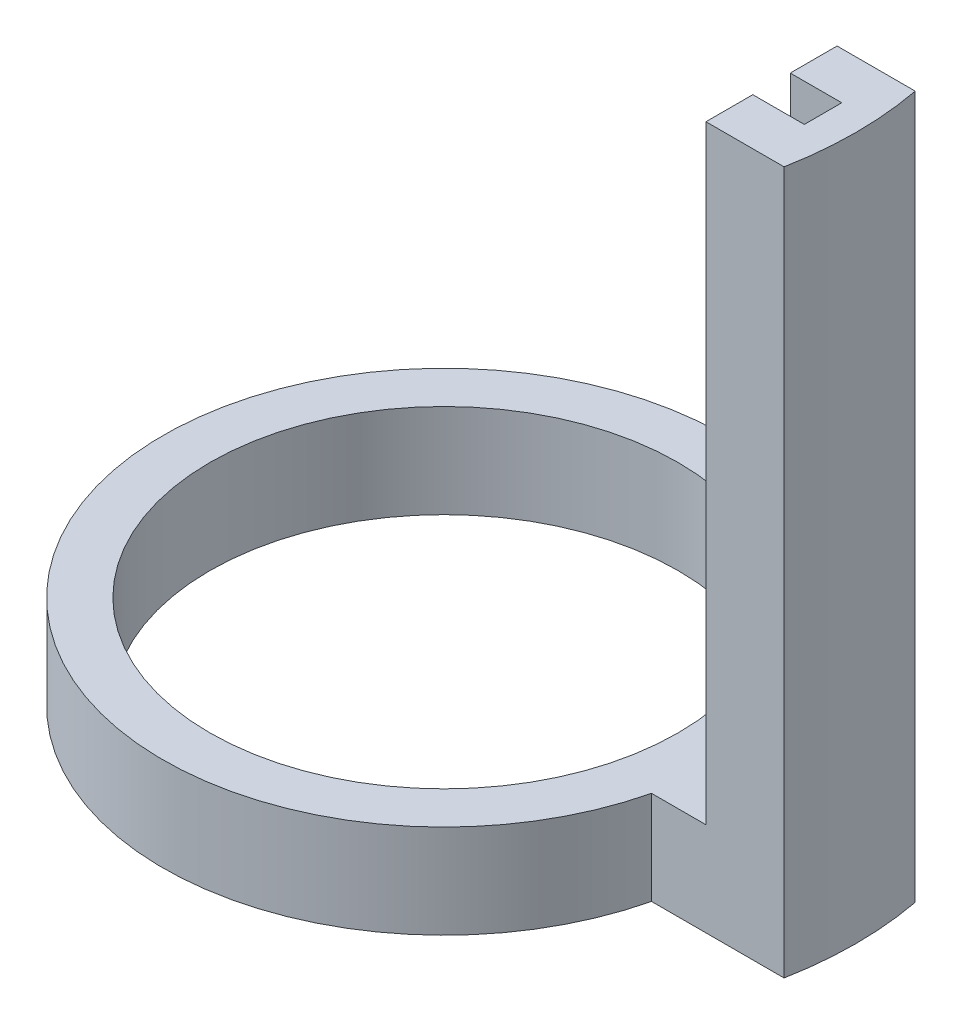
ISO-10303-21;
HEADER;
FILE_DESCRIPTION(('STEP AP214'),'2;1');
FILE_NAME('part.step','',(''),(''),'','','');
FILE_SCHEMA(('AUTOMOTIVE_DESIGN { 1 0 10303 214 1 1 1 1 }'));
ENDSEC;
DATA;
#1=APPLICATION_CONTEXT('core data for automotive mechanical design processes');
#2=APPLICATION_PROTOCOL_DEFINITION('international standard','automotive_design',2000,#1);
#3=PRODUCT_CONTEXT('',#1,'mechanical');
#4=PRODUCT('Part','Part','',(#3));
#5=PRODUCT_RELATED_PRODUCT_CATEGORY('part','',(#4));
#6=PRODUCT_DEFINITION_FORMATION('','',#4);
#7=PRODUCT_DEFINITION_CONTEXT('part definition',#1,'design');
#8=PRODUCT_DEFINITION('design','',#6,#7);
#9=PRODUCT_DEFINITION_SHAPE('','',#8);
#10=(LENGTH_UNIT() NAMED_UNIT(*) SI_UNIT(.MILLI.,.METRE.));
#11=(NAMED_UNIT(*) PLANE_ANGLE_UNIT() SI_UNIT($,.RADIAN.));
#12=(NAMED_UNIT(*) SI_UNIT($,.STERADIAN.) SOLID_ANGLE_UNIT());
#13=UNCERTAINTY_MEASURE_WITH_UNIT(LENGTH_MEASURE(1.E-05),#10,'distance_accuracy_value','');
#14=(GEOMETRIC_REPRESENTATION_CONTEXT(3) GLOBAL_UNCERTAINTY_ASSIGNED_CONTEXT((#13)) GLOBAL_UNIT_ASSIGNED_CONTEXT((#10,
#11,#12)) REPRESENTATION_CONTEXT('',''));
#15=CARTESIAN_POINT('',(0.,0.,0.));
#16=DIRECTION('',(0.,0.,1.));
#17=DIRECTION('',(1.,0.,0.));
#18=AXIS2_PLACEMENT_3D('',#15,#16,#17);
#19=CARTESIAN_POINT('',(61.9470591331992,20.,0.));
#20=DIRECTION('',(1.,0.,0.));
#21=DIRECTION('',(0.,0.,-1.));
#22=AXIS2_PLACEMENT_3D('',#19,#20,#21);
#23=PLANE('',#22);
#24=DIRECTION('',(0.,-1.,0.));
#25=VECTOR('',#24,1.);
#26=CARTESIAN_POINT('',(61.9470591331992,150.,4.02210053993576));
#27=LINE('',#26,#25);
#28=CARTESIAN_POINT('',(61.9470591331992,20.,4.02210053993576));
#29=VERTEX_POINT('',#28);
#30=CARTESIAN_POINT('',(61.9470591331992,0.,4.02210053993576));
#31=VERTEX_POINT('',#30);
#32=EDGE_CURVE('E140',#29,#31,#27,.T.);
#33=ORIENTED_EDGE('',*,*,#32,.T.);
#34=DIRECTION('',(0.,0.,1.));
#35=VECTOR('',#34,1.);
#36=CARTESIAN_POINT('',(61.9470591331992,0.,0.));
#37=LINE('',#36,#35);
#38=CARTESIAN_POINT('',(61.9470591331992,0.,-3.97870375115252));
#39=VERTEX_POINT('',#38);
#40=EDGE_CURVE('E111',#39,#31,#37,.T.);
#41=ORIENTED_EDGE('',*,*,#40,.F.);
#42=DIRECTION('',(0.,-1.,0.));
#43=VECTOR('',#42,1.);
#44=CARTESIAN_POINT('',(61.9470591331992,150.,-3.97870375115252));
#45=LINE('',#44,#43);
#46=CARTESIAN_POINT('',(61.9470591331992,20.,-3.97870375115252));
#47=VERTEX_POINT('',#46);
#48=EDGE_CURVE('E159',#47,#39,#45,.T.);
#49=ORIENTED_EDGE('',*,*,#48,.F.);
#50=DIRECTION('',(0.,0.,1.));
#51=VECTOR('',#50,1.);
#52=CARTESIAN_POINT('',(61.9470591331992,20.,0.));
#53=LINE('',#52,#51);
#54=EDGE_CURVE('E106',#47,#29,#53,.T.);
#55=ORIENTED_EDGE('',*,*,#54,.T.);
#56=EDGE_LOOP('',(#33,#41,#49,#55));
#57=FACE_BOUND('',#56,.T.);
#58=ADVANCED_FACE('F39',(#57),#23,.T.);
#59=CARTESIAN_POINT('',(0.,20.,-13.9787037511525));
#60=DIRECTION('',(0.,0.,1.));
#61=DIRECTION('',(1.,0.,0.));
#62=AXIS2_PLACEMENT_3D('',#59,#60,#61);
#63=PLANE('',#62);
#64=DIRECTION('',(-1.,0.,0.));
#65=VECTOR('',#64,1.);
#66=CARTESIAN_POINT('',(0.,0.,-13.9787037511525));
#67=LINE('',#66,#65);
#68=CARTESIAN_POINT('',(78.6328504462978,0.,-13.9787037511525));
#69=VERTEX_POINT('',#68);
#70=CARTESIAN_POINT('',(50.3391647642275,0.,-13.9787037511525));
#71=VERTEX_POINT('',#70);
#72=EDGE_CURVE('E85',#69,#71,#67,.T.);
#73=ORIENTED_EDGE('',*,*,#72,.T.);
#74=DIRECTION('',(0.,-1.,0.));
#75=VECTOR('',#74,1.);
#76=CARTESIAN_POINT('',(50.3391647642275,20.,-13.9787037511525));
#77=LINE('',#76,#75);
#78=CARTESIAN_POINT('',(50.3391647642275,20.,-13.9787037511525));
#79=VERTEX_POINT('',#78);
#80=EDGE_CURVE('E11',#79,#71,#77,.T.);
#81=ORIENTED_EDGE('',*,*,#80,.F.);
#82=DIRECTION('',(-1.,0.,0.));
#83=VECTOR('',#82,1.);
#84=CARTESIAN_POINT('',(0.,20.,-13.9787037511525));
#85=LINE('',#84,#83);
#86=CARTESIAN_POINT('',(61.9470591331992,20.,-13.9787037511525));
#87=VERTEX_POINT('',#86);
#88=EDGE_CURVE('E122',#87,#79,#85,.T.);
#89=ORIENTED_EDGE('',*,*,#88,.F.);
#90=DIRECTION('',(0.,-1.,0.));
#91=VECTOR('',#90,1.);
#92=CARTESIAN_POINT('',(61.9470591331992,150.,-13.9787037511525));
#93=LINE('',#92,#91);
#94=CARTESIAN_POINT('',(61.9470591331992,150.,-13.9787037511525));
#95=VERTEX_POINT('',#94);
#96=EDGE_CURVE('E151',#95,#87,#93,.T.);
#97=ORIENTED_EDGE('',*,*,#96,.F.);
#98=DIRECTION('',(-1.,0.,0.));
#99=VECTOR('',#98,1.);
#100=CARTESIAN_POINT('',(0.,150.,-13.9787037511525));
#101=LINE('',#100,#99);
#102=CARTESIAN_POINT('',(78.6328504462978,150.,-13.9787037511525));
#103=VERTEX_POINT('',#102);
#104=EDGE_CURVE('E184',#103,#95,#101,.T.);
#105=ORIENTED_EDGE('',*,*,#104,.F.);
#106=DIRECTION('',(0.,-1.,0.));
#107=VECTOR('',#106,1.);
#108=CARTESIAN_POINT('',(78.6328504462978,150.,-13.9787037511525));
#109=LINE('',#108,#107);
#110=EDGE_CURVE('E147',#103,#69,#109,.T.);
#111=ORIENTED_EDGE('',*,*,#110,.T.);
#112=EDGE_LOOP('',(#73,#81,#89,#97,#105,#111));
#113=FACE_BOUND('',#112,.T.);
#114=ADVANCED_FACE('F283',(#113),#63,.F.);
#115=CARTESIAN_POINT('',(-8.00974989095282,20.,0.));
#116=DIRECTION('',(0.,-1.,0.));
#117=DIRECTION('',(0.,0.,-1.));
#118=AXIS2_PLACEMENT_3D('',#115,#116,#117);
#119=CYLINDRICAL_SURFACE('',#118,60.);
#120=CARTESIAN_POINT('',(-8.00974989095282,0.,0.));
#121=DIRECTION('',(0.,1.,0.));
#122=DIRECTION('',(0.,0.,1.));
#123=AXIS2_PLACEMENT_3D('',#120,#121,#122);
#124=CIRCLE('',#123,60.);
#125=CARTESIAN_POINT('',(50.3287510877999,0.,14.0221005399358));
#126=VERTEX_POINT('',#125);
#127=EDGE_CURVE('E75',#71,#126,#124,.T.);
#128=ORIENTED_EDGE('',*,*,#127,.T.);
#129=DIRECTION('',(0.,-1.,0.));
#130=VECTOR('',#129,1.);
#131=CARTESIAN_POINT('',(50.3287510877999,20.,14.0221005399358));
#132=LINE('',#131,#130);
#133=CARTESIAN_POINT('',(50.3287510877999,20.,14.0221005399358));
#134=VERTEX_POINT('',#133);
#135=EDGE_CURVE('E47',#134,#126,#132,.T.);
#136=ORIENTED_EDGE('',*,*,#135,.F.);
#137=CARTESIAN_POINT('',(-8.00974989095282,20.,0.));
#138=DIRECTION('',(0.,1.,0.));
#139=DIRECTION('',(0.,0.,1.));
#140=AXIS2_PLACEMENT_3D('',#137,#138,#139);
#141=CIRCLE('',#140,60.);
#142=EDGE_CURVE('E63',#79,#134,#141,.T.);
#143=ORIENTED_EDGE('',*,*,#142,.F.);
#144=ORIENTED_EDGE('',*,*,#80,.T.);
#145=EDGE_LOOP('',(#128,#136,#143,#144));
#146=FACE_BOUND('',#145,.T.);
#147=ADVANCED_FACE('F77',(#146),#119,.T.);
#148=CARTESIAN_POINT('',(0.,20.,14.0221005399358));
#149=DIRECTION('',(0.,0.,-1.));
#150=DIRECTION('',(-1.,0.,0.));
#151=AXIS2_PLACEMENT_3D('',#148,#149,#150);
#152=PLANE('',#151);
#153=DIRECTION('',(1.,0.,0.));
#154=VECTOR('',#153,1.);
#155=CARTESIAN_POINT('',(0.,0.,14.0221005399358));
#156=LINE('',#155,#154);
#157=CARTESIAN_POINT('',(78.6246045350917,0.,14.0221005399358));
#158=VERTEX_POINT('',#157);
#159=EDGE_CURVE('E84',#126,#158,#156,.T.);
#160=ORIENTED_EDGE('',*,*,#159,.T.);
#161=DIRECTION('',(0.,-1.,0.));
#162=VECTOR('',#161,1.);
#163=CARTESIAN_POINT('',(78.6246045350917,150.,14.0221005399358));
#164=LINE('',#163,#162);
#165=CARTESIAN_POINT('',(78.6246045350917,150.,14.0221005399358));
#166=VERTEX_POINT('',#165);
#167=EDGE_CURVE('E144',#166,#158,#164,.T.);
#168=ORIENTED_EDGE('',*,*,#167,.F.);
#169=DIRECTION('',(1.,0.,0.));
#170=VECTOR('',#169,1.);
#171=CARTESIAN_POINT('',(0.,150.,14.0221005399358));
#172=LINE('',#171,#170);
#173=CARTESIAN_POINT('',(61.9470591331992,150.,14.0221005399358));
#174=VERTEX_POINT('',#173);
#175=EDGE_CURVE('E192',#174,#166,#172,.T.);
#176=ORIENTED_EDGE('',*,*,#175,.F.);
#177=DIRECTION('',(0.,-1.,0.));
#178=VECTOR('',#177,1.);
#179=CARTESIAN_POINT('',(61.9470591331992,150.,14.0221005399358));
#180=LINE('',#179,#178);
#181=CARTESIAN_POINT('',(61.9470591331992,20.,14.0221005399358));
#182=VERTEX_POINT('',#181);
#183=EDGE_CURVE('E141',#174,#182,#180,.T.);
#184=ORIENTED_EDGE('',*,*,#183,.T.);
#185=DIRECTION('',(1.,0.,0.));
#186=VECTOR('',#185,1.);
#187=CARTESIAN_POINT('',(0.,20.,14.0221005399358));
#188=LINE('',#187,#186);
#189=EDGE_CURVE('E94',#134,#182,#188,.T.);
#190=ORIENTED_EDGE('',*,*,#189,.F.);
#191=ORIENTED_EDGE('',*,*,#135,.T.);
#192=EDGE_LOOP('',(#160,#168,#176,#184,#190,#191));
#193=FACE_BOUND('',#192,.T.);
#194=ADVANCED_FACE('F89',(#193),#152,.F.);
#195=CARTESIAN_POINT('',(-8.00974989095282,20.,0.));
#196=DIRECTION('',(0.,-1.,0.));
#197=DIRECTION('',(0.,0.,-1.));
#198=AXIS2_PLACEMENT_3D('',#195,#196,#197);
#199=CYLINDRICAL_SURFACE('',#198,50.);
#200=CARTESIAN_POINT('',(-8.00974989095282,20.,0.));
#201=DIRECTION('',(0.,1.,0.));
#202=DIRECTION('',(0.,0.,1.));
#203=AXIS2_PLACEMENT_3D('',#200,#201,#202);
#204=CIRCLE('',#203,50.);
#205=CARTESIAN_POINT('',(-8.00974989095282,20.,50.));
#206=VERTEX_POINT('',#205);
#207=EDGE_CURVE('E96',#206,#206,#204,.T.);
#208=ORIENTED_EDGE('',*,*,#207,.T.);
#209=EDGE_LOOP('',(#208));
#210=FACE_BOUND('',#209,.T.);
#211=CARTESIAN_POINT('',(-8.00974989095282,0.,0.));
#212=DIRECTION('',(0.,1.,0.));
#213=DIRECTION('',(0.,0.,1.));
#214=AXIS2_PLACEMENT_3D('',#211,#212,#213);
#215=CIRCLE('',#214,50.);
#216=CARTESIAN_POINT('',(-8.00974989095282,0.,50.));
#217=VERTEX_POINT('',#216);
#218=EDGE_CURVE('E102',#217,#217,#215,.T.);
#219=ORIENTED_EDGE('',*,*,#218,.F.);
#220=EDGE_LOOP('',(#219));
#221=FACE_BOUND('',#220,.T.);
#222=ADVANCED_FACE('F267',(#210,#221),#199,.F.);
#223=CARTESIAN_POINT('',(0.,20.,0.));
#224=DIRECTION('',(0.,1.,0.));
#225=DIRECTION('',(0.,0.,1.));
#226=AXIS2_PLACEMENT_3D('',#223,#224,#225);
#227=PLANE('',#226);
#228=EDGE_CURVE('E125',#87,#47,#53,.T.);
#229=ORIENTED_EDGE('',*,*,#228,.F.);
#230=ORIENTED_EDGE('',*,*,#88,.T.);
#231=ORIENTED_EDGE('',*,*,#142,.T.);
#232=ORIENTED_EDGE('',*,*,#189,.T.);
#233=DIRECTION('',(0.,0.,-1.));
#234=VECTOR('',#233,1.);
#235=CARTESIAN_POINT('',(61.9470591331992,20.,0.));
#236=LINE('',#235,#234);
#237=EDGE_CURVE('E114',#182,#29,#236,.T.);
#238=ORIENTED_EDGE('',*,*,#237,.T.);
#239=ORIENTED_EDGE('',*,*,#54,.F.);
#240=EDGE_LOOP('',(#229,#230,#231,#232,#238,#239));
#241=FACE_BOUND('',#240,.T.);
#242=ORIENTED_EDGE('',*,*,#207,.F.);
#243=EDGE_LOOP('',(#242));
#244=FACE_BOUND('',#243,.T.);
#245=ADVANCED_FACE('F264',(#241,#244),#227,.T.);
#246=CARTESIAN_POINT('',(0.,0.,0.));
#247=DIRECTION('',(0.,1.,0.));
#248=DIRECTION('',(0.,0.,1.));
#249=AXIS2_PLACEMENT_3D('',#246,#247,#248);
#250=PLANE('',#249);
#251=CARTESIAN_POINT('',(4.94705913319886,0.,0.));
#252=DIRECTION('',(0.,1.,0.));
#253=DIRECTION('',(0.,0.,1.));
#254=AXIS2_PLACEMENT_3D('',#251,#252,#253);
#255=CIRCLE('',#254,75.0000000000003);
#256=EDGE_CURVE('E100',#158,#69,#255,.T.);
#257=ORIENTED_EDGE('',*,*,#256,.F.);
#258=ORIENTED_EDGE('',*,*,#159,.F.);
#259=ORIENTED_EDGE('',*,*,#127,.F.);
#260=ORIENTED_EDGE('',*,*,#72,.F.);
#261=EDGE_LOOP('',(#257,#258,#259,#260));
#262=FACE_BOUND('',#261,.T.);
#263=ORIENTED_EDGE('',*,*,#40,.T.);
#264=DIRECTION('',(1.,0.,0.));
#265=VECTOR('',#264,1.);
#266=CARTESIAN_POINT('',(0.,0.,4.02210053993577));
#267=LINE('',#266,#265);
#268=CARTESIAN_POINT('',(72.9470591331992,0.,4.02210053993575));
#269=VERTEX_POINT('',#268);
#270=EDGE_CURVE('E170',#31,#269,#267,.T.);
#271=ORIENTED_EDGE('',*,*,#270,.T.);
#272=DIRECTION('',(0.,0.,-1.));
#273=VECTOR('',#272,1.);
#274=CARTESIAN_POINT('',(72.9470591331992,0.,0.));
#275=LINE('',#274,#273);
#276=CARTESIAN_POINT('',(72.9470591331992,0.,-3.97870375115251));
#277=VERTEX_POINT('',#276);
#278=EDGE_CURVE('E174',#269,#277,#275,.T.);
#279=ORIENTED_EDGE('',*,*,#278,.T.);
#280=DIRECTION('',(1.,0.,0.));
#281=VECTOR('',#280,1.);
#282=CARTESIAN_POINT('',(0.,0.,-3.97870375115252));
#283=LINE('',#282,#281);
#284=EDGE_CURVE('E54',#39,#277,#283,.T.);
#285=ORIENTED_EDGE('',*,*,#284,.F.);
#286=EDGE_LOOP('',(#263,#271,#279,#285));
#287=FACE_BOUND('',#286,.T.);
#288=ORIENTED_EDGE('',*,*,#218,.T.);
#289=EDGE_LOOP('',(#288));
#290=FACE_BOUND('',#289,.T.);
#291=ADVANCED_FACE('F98',(#262,#287,#290),#250,.F.);
#292=CARTESIAN_POINT('',(72.9470591331992,150.,0.));
#293=DIRECTION('',(-1.,0.,0.));
#294=DIRECTION('',(0.,0.,1.));
#295=AXIS2_PLACEMENT_3D('',#292,#293,#294);
#296=PLANE('',#295);
#297=ORIENTED_EDGE('',*,*,#278,.F.);
#298=DIRECTION('',(0.,-1.,0.));
#299=VECTOR('',#298,1.);
#300=CARTESIAN_POINT('',(72.9470591331992,150.,4.02210053993575));
#301=LINE('',#300,#299);
#302=CARTESIAN_POINT('',(72.9470591331992,150.,4.02210053993575));
#303=VERTEX_POINT('',#302);
#304=EDGE_CURVE('E132',#303,#269,#301,.T.);
#305=ORIENTED_EDGE('',*,*,#304,.F.);
#306=DIRECTION('',(0.,0.,-1.));
#307=VECTOR('',#306,1.);
#308=CARTESIAN_POINT('',(72.9470591331992,150.,0.));
#309=LINE('',#308,#307);
#310=CARTESIAN_POINT('',(72.9470591331992,150.,-3.97870375115251));
#311=VERTEX_POINT('',#310);
#312=EDGE_CURVE('E167',#303,#311,#309,.T.);
#313=ORIENTED_EDGE('',*,*,#312,.T.);
#314=DIRECTION('',(0.,-1.,0.));
#315=VECTOR('',#314,1.);
#316=CARTESIAN_POINT('',(72.9470591331992,150.,-3.97870375115251));
#317=LINE('',#316,#315);
#318=EDGE_CURVE('E160',#311,#277,#317,.T.);
#319=ORIENTED_EDGE('',*,*,#318,.T.);
#320=EDGE_LOOP('',(#297,#305,#313,#319));
#321=FACE_BOUND('',#320,.T.);
#322=ADVANCED_FACE('F211',(#321),#296,.T.);
#323=CARTESIAN_POINT('',(0.,150.,4.02210053993577));
#324=DIRECTION('',(0.,0.,-1.));
#325=DIRECTION('',(-1.,0.,0.));
#326=AXIS2_PLACEMENT_3D('',#323,#324,#325);
#327=PLANE('',#326);
#328=ORIENTED_EDGE('',*,*,#270,.F.);
#329=ORIENTED_EDGE('',*,*,#32,.F.);
#330=CARTESIAN_POINT('',(61.9470591331992,150.,4.02210053993576));
#331=VERTEX_POINT('',#330);
#332=EDGE_CURVE('E136',#331,#29,#27,.T.);
#333=ORIENTED_EDGE('',*,*,#332,.F.);
#334=DIRECTION('',(1.,0.,0.));
#335=VECTOR('',#334,1.);
#336=CARTESIAN_POINT('',(0.,150.,4.02210053993577));
#337=LINE('',#336,#335);
#338=EDGE_CURVE('E200',#331,#303,#337,.T.);
#339=ORIENTED_EDGE('',*,*,#338,.T.);
#340=ORIENTED_EDGE('',*,*,#304,.T.);
#341=EDGE_LOOP('',(#328,#329,#333,#339,#340));
#342=FACE_BOUND('',#341,.T.);
#343=ADVANCED_FACE('F228',(#342),#327,.T.);
#344=CARTESIAN_POINT('',(61.9470591331992,150.,0.));
#345=DIRECTION('',(1.,0.,0.));
#346=DIRECTION('',(0.,0.,-1.));
#347=AXIS2_PLACEMENT_3D('',#344,#345,#346);
#348=PLANE('',#347);
#349=ORIENTED_EDGE('',*,*,#237,.F.);
#350=ORIENTED_EDGE('',*,*,#183,.F.);
#351=DIRECTION('',(0.,0.,1.));
#352=VECTOR('',#351,1.);
#353=CARTESIAN_POINT('',(61.9470591331992,150.,0.));
#354=LINE('',#353,#352);
#355=EDGE_CURVE('E196',#331,#174,#354,.T.);
#356=ORIENTED_EDGE('',*,*,#355,.F.);
#357=ORIENTED_EDGE('',*,*,#332,.T.);
#358=EDGE_LOOP('',(#349,#350,#356,#357));
#359=FACE_BOUND('',#358,.T.);
#360=ADVANCED_FACE('F238',(#359),#348,.F.);
#361=CARTESIAN_POINT('',(4.94705913319886,150.,0.));
#362=DIRECTION('',(0.,-1.,0.));
#363=DIRECTION('',(0.,0.,-1.));
#364=AXIS2_PLACEMENT_3D('',#361,#362,#363);
#365=CYLINDRICAL_SURFACE('',#364,75.0000000000003);
#366=ORIENTED_EDGE('',*,*,#256,.T.);
#367=ORIENTED_EDGE('',*,*,#110,.F.);
#368=CARTESIAN_POINT('',(4.94705913319886,150.,0.));
#369=DIRECTION('',(0.,1.,0.));
#370=DIRECTION('',(0.,0.,1.));
#371=AXIS2_PLACEMENT_3D('',#368,#369,#370);
#372=CIRCLE('',#371,75.0000000000003);
#373=EDGE_CURVE('E188',#166,#103,#372,.T.);
#374=ORIENTED_EDGE('',*,*,#373,.F.);
#375=ORIENTED_EDGE('',*,*,#167,.T.);
#376=EDGE_LOOP('',(#366,#367,#374,#375));
#377=FACE_BOUND('',#376,.T.);
#378=ADVANCED_FACE('F303',(#377),#365,.T.);
#379=CARTESIAN_POINT('',(61.9470591331992,150.,0.));
#380=DIRECTION('',(-1.,0.,0.));
#381=DIRECTION('',(0.,0.,1.));
#382=AXIS2_PLACEMENT_3D('',#379,#380,#381);
#383=PLANE('',#382);
#384=ORIENTED_EDGE('',*,*,#96,.T.);
#385=ORIENTED_EDGE('',*,*,#228,.T.);
#386=CARTESIAN_POINT('',(61.9470591331992,150.,-3.97870375115252));
#387=VERTEX_POINT('',#386);
#388=EDGE_CURVE('E155',#387,#47,#45,.T.);
#389=ORIENTED_EDGE('',*,*,#388,.F.);
#390=DIRECTION('',(0.,0.,-1.));
#391=VECTOR('',#390,1.);
#392=CARTESIAN_POINT('',(61.9470591331992,150.,0.));
#393=LINE('',#392,#391);
#394=EDGE_CURVE('E180',#387,#95,#393,.T.);
#395=ORIENTED_EDGE('',*,*,#394,.T.);
#396=EDGE_LOOP('',(#384,#385,#389,#395));
#397=FACE_BOUND('',#396,.T.);
#398=ADVANCED_FACE('F297',(#397),#383,.T.);
#399=CARTESIAN_POINT('',(0.,150.,-3.97870375115252));
#400=DIRECTION('',(0.,0.,-1.));
#401=DIRECTION('',(-1.,0.,0.));
#402=AXIS2_PLACEMENT_3D('',#399,#400,#401);
#403=PLANE('',#402);
#404=ORIENTED_EDGE('',*,*,#284,.T.);
#405=ORIENTED_EDGE('',*,*,#318,.F.);
#406=DIRECTION('',(1.,0.,0.));
#407=VECTOR('',#406,1.);
#408=CARTESIAN_POINT('',(0.,150.,-3.97870375115252));
#409=LINE('',#408,#407);
#410=EDGE_CURVE('E164',#387,#311,#409,.T.);
#411=ORIENTED_EDGE('',*,*,#410,.F.);
#412=ORIENTED_EDGE('',*,*,#388,.T.);
#413=ORIENTED_EDGE('',*,*,#48,.T.);
#414=EDGE_LOOP('',(#404,#405,#411,#412,#413));
#415=FACE_BOUND('',#414,.T.);
#416=ADVANCED_FACE('F294',(#415),#403,.F.);
#417=CARTESIAN_POINT('',(0.,150.,0.));
#418=DIRECTION('',(0.,1.,0.));
#419=DIRECTION('',(0.,0.,1.));
#420=AXIS2_PLACEMENT_3D('',#417,#418,#419);
#421=PLANE('',#420);
#422=ORIENTED_EDGE('',*,*,#312,.F.);
#423=ORIENTED_EDGE('',*,*,#338,.F.);
#424=ORIENTED_EDGE('',*,*,#355,.T.);
#425=ORIENTED_EDGE('',*,*,#175,.T.);
#426=ORIENTED_EDGE('',*,*,#373,.T.);
#427=ORIENTED_EDGE('',*,*,#104,.T.);
#428=ORIENTED_EDGE('',*,*,#394,.F.);
#429=ORIENTED_EDGE('',*,*,#410,.T.);
#430=EDGE_LOOP('',(#422,#423,#424,#425,#426,#427,#428,#429));
#431=FACE_BOUND('',#430,.T.);
#432=ADVANCED_FACE('F220',(#431),#421,.T.);
#433=CLOSED_SHELL('',(#58,#114,#147,#194,#222,#245,#291,#322,#343,#360,#378,#398,#416,#432));
#434=MANIFOLD_SOLID_BREP('B2',#433);
#435=ADVANCED_BREP_SHAPE_REPRESENTATION('',(#18,#434),#14);
#436=SHAPE_DEFINITION_REPRESENTATION(#9,#435);
ENDSEC;
END-ISO-10303-21;
